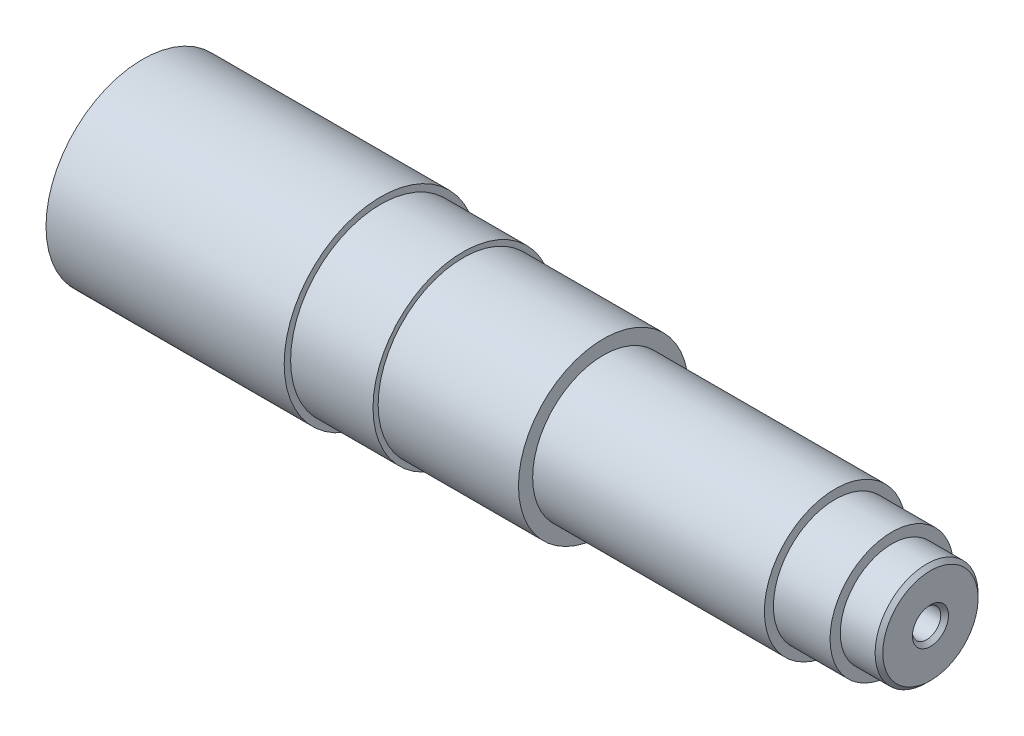
ISO-10303-21;
HEADER;
FILE_DESCRIPTION(('STEP AP214'),'2;1');
FILE_NAME('part.step','',(''),(''),'','','');
FILE_SCHEMA(('AUTOMOTIVE_DESIGN { 1 0 10303 214 1 1 1 1 }'));
ENDSEC;
DATA;
#1=APPLICATION_CONTEXT('core data for automotive mechanical design processes');
#2=APPLICATION_PROTOCOL_DEFINITION('international standard','automotive_design',2000,#1);
#3=PRODUCT_CONTEXT('',#1,'mechanical');
#4=PRODUCT('Part','Part','',(#3));
#5=PRODUCT_RELATED_PRODUCT_CATEGORY('part','',(#4));
#6=PRODUCT_DEFINITION_FORMATION('','',#4);
#7=PRODUCT_DEFINITION_CONTEXT('part definition',#1,'design');
#8=PRODUCT_DEFINITION('design','',#6,#7);
#9=PRODUCT_DEFINITION_SHAPE('','',#8);
#10=(LENGTH_UNIT() NAMED_UNIT(*) SI_UNIT(.MILLI.,.METRE.));
#11=(NAMED_UNIT(*) PLANE_ANGLE_UNIT() SI_UNIT($,.RADIAN.));
#12=(NAMED_UNIT(*) SI_UNIT($,.STERADIAN.) SOLID_ANGLE_UNIT());
#13=UNCERTAINTY_MEASURE_WITH_UNIT(LENGTH_MEASURE(1.E-05),#10,'distance_accuracy_value','');
#14=(GEOMETRIC_REPRESENTATION_CONTEXT(3) GLOBAL_UNCERTAINTY_ASSIGNED_CONTEXT((#13)) GLOBAL_UNIT_ASSIGNED_CONTEXT((#10,
#11,#12)) REPRESENTATION_CONTEXT('',''));
#15=CARTESIAN_POINT('',(0.,0.,0.));
#16=DIRECTION('',(0.,0.,1.));
#17=DIRECTION('',(1.,0.,0.));
#18=AXIS2_PLACEMENT_3D('',#15,#16,#17);
#19=CARTESIAN_POINT('',(0.,0.,0.));
#20=DIRECTION('',(1.,0.,0.));
#21=DIRECTION('',(0.,0.,-1.));
#22=AXIS2_PLACEMENT_3D('',#19,#20,#21);
#23=PLANE('',#22);
#24=CARTESIAN_POINT('',(0.,0.,0.));
#25=DIRECTION('',(-1.,0.,0.));
#26=DIRECTION('',(0.,0.,1.));
#27=AXIS2_PLACEMENT_3D('',#24,#25,#26);
#28=CIRCLE('',#27,7.);
#29=CARTESIAN_POINT('',(0.,0.,7.));
#30=VERTEX_POINT('',#29);
#31=EDGE_CURVE('E64',#30,#30,#28,.T.);
#32=ORIENTED_EDGE('',*,*,#31,.F.);
#33=EDGE_LOOP('',(#32));
#34=FACE_BOUND('',#33,.T.);
#35=CARTESIAN_POINT('',(0.,0.,0.));
#36=DIRECTION('',(-1.,0.,0.));
#37=DIRECTION('',(0.,0.,1.));
#38=AXIS2_PLACEMENT_3D('',#35,#36,#37);
#39=CIRCLE('',#38,12.2);
#40=CARTESIAN_POINT('',(0.,0.,12.2));
#41=VERTEX_POINT('',#40);
#42=EDGE_CURVE('E11',#41,#41,#39,.T.);
#43=ORIENTED_EDGE('',*,*,#42,.T.);
#44=EDGE_LOOP('',(#43));
#45=FACE_BOUND('',#44,.T.);
#46=ADVANCED_FACE('F39',(#34,#45),#23,.F.);
#47=CARTESIAN_POINT('',(2.5,0.,0.));
#48=DIRECTION('',(1.,0.,0.));
#49=DIRECTION('',(0.,0.,-1.));
#50=AXIS2_PLACEMENT_3D('',#47,#48,#49);
#51=CONICAL_SURFACE('',#50,14.7,0.785398163397448);
#52=ORIENTED_EDGE('',*,*,#42,.F.);
#53=EDGE_LOOP('',(#52));
#54=FACE_BOUND('',#53,.T.);
#55=CARTESIAN_POINT('',(2.5,0.,0.));
#56=DIRECTION('',(-1.,0.,0.));
#57=DIRECTION('',(0.,0.,1.));
#58=AXIS2_PLACEMENT_3D('',#55,#56,#57);
#59=CIRCLE('',#58,14.7);
#60=CARTESIAN_POINT('',(2.5,0.,14.7));
#61=VERTEX_POINT('',#60);
#62=EDGE_CURVE('E47',#61,#61,#59,.T.);
#63=ORIENTED_EDGE('',*,*,#62,.T.);
#64=EDGE_LOOP('',(#63));
#65=FACE_BOUND('',#64,.T.);
#66=ADVANCED_FACE('F143',(#54,#65),#51,.T.);
#67=CARTESIAN_POINT('',(0.,0.,0.));
#68=DIRECTION('',(-1.,0.,0.));
#69=DIRECTION('',(0.,0.,1.));
#70=AXIS2_PLACEMENT_3D('',#67,#68,#69);
#71=CYLINDRICAL_SURFACE('',#70,14.7);
#72=ORIENTED_EDGE('',*,*,#62,.F.);
#73=EDGE_LOOP('',(#72));
#74=FACE_BOUND('',#73,.T.);
#75=CARTESIAN_POINT('',(17.,0.,0.));
#76=DIRECTION('',(-1.,0.,0.));
#77=DIRECTION('',(0.,0.,1.));
#78=AXIS2_PLACEMENT_3D('',#75,#76,#77);
#79=CIRCLE('',#78,14.7);
#80=CARTESIAN_POINT('',(17.,0.,14.7));
#81=VERTEX_POINT('',#80);
#82=EDGE_CURVE('E136',#81,#81,#79,.T.);
#83=ORIENTED_EDGE('',*,*,#82,.T.);
#84=EDGE_LOOP('',(#83));
#85=FACE_BOUND('',#84,.T.);
#86=ADVANCED_FACE('F145',(#74,#85),#71,.T.);
#87=CARTESIAN_POINT('',(17.,14.7,0.));
#88=DIRECTION('',(1.,0.,0.));
#89=DIRECTION('',(0.,0.,-1.));
#90=AXIS2_PLACEMENT_3D('',#87,#88,#89);
#91=PLANE('',#90);
#92=ORIENTED_EDGE('',*,*,#82,.F.);
#93=EDGE_LOOP('',(#92));
#94=FACE_BOUND('',#93,.T.);
#95=CARTESIAN_POINT('',(17.,0.,0.));
#96=DIRECTION('',(-1.,0.,0.));
#97=DIRECTION('',(0.,0.,1.));
#98=AXIS2_PLACEMENT_3D('',#95,#96,#97);
#99=CIRCLE('',#98,37.5);
#100=CARTESIAN_POINT('',(17.,0.,37.5));
#101=VERTEX_POINT('',#100);
#102=EDGE_CURVE('E132',#101,#101,#99,.T.);
#103=ORIENTED_EDGE('',*,*,#102,.T.);
#104=EDGE_LOOP('',(#103));
#105=FACE_BOUND('',#104,.T.);
#106=ADVANCED_FACE('F148',(#94,#105),#91,.F.);
#107=CARTESIAN_POINT('',(0.,0.,0.));
#108=DIRECTION('',(-1.,0.,0.));
#109=DIRECTION('',(0.,0.,1.));
#110=AXIS2_PLACEMENT_3D('',#107,#108,#109);
#111=CYLINDRICAL_SURFACE('',#110,37.5);
#112=ORIENTED_EDGE('',*,*,#102,.F.);
#113=EDGE_LOOP('',(#112));
#114=FACE_BOUND('',#113,.T.);
#115=CARTESIAN_POINT('',(109.5,0.,0.));
#116=DIRECTION('',(-1.,0.,0.));
#117=DIRECTION('',(0.,0.,1.));
#118=AXIS2_PLACEMENT_3D('',#115,#116,#117);
#119=CIRCLE('',#118,37.5);
#120=CARTESIAN_POINT('',(109.5,0.,37.5));
#121=VERTEX_POINT('',#120);
#122=EDGE_CURVE('E128',#121,#121,#119,.T.);
#123=ORIENTED_EDGE('',*,*,#122,.T.);
#124=EDGE_LOOP('',(#123));
#125=FACE_BOUND('',#124,.T.);
#126=ADVANCED_FACE('F154',(#114,#125),#111,.T.);
#127=CARTESIAN_POINT('',(109.5,37.5,0.));
#128=DIRECTION('',(-1.,0.,0.));
#129=DIRECTION('',(0.,0.,1.));
#130=AXIS2_PLACEMENT_3D('',#127,#128,#129);
#131=PLANE('',#130);
#132=ORIENTED_EDGE('',*,*,#122,.F.);
#133=EDGE_LOOP('',(#132));
#134=FACE_BOUND('',#133,.T.);
#135=CARTESIAN_POINT('',(109.5,0.,0.));
#136=DIRECTION('',(-1.,0.,0.));
#137=DIRECTION('',(0.,0.,1.));
#138=AXIS2_PLACEMENT_3D('',#135,#136,#137);
#139=CIRCLE('',#138,35.);
#140=CARTESIAN_POINT('',(109.5,0.,35.));
#141=VERTEX_POINT('',#140);
#142=EDGE_CURVE('E124',#141,#141,#139,.T.);
#143=ORIENTED_EDGE('',*,*,#142,.T.);
#144=EDGE_LOOP('',(#143));
#145=FACE_BOUND('',#144,.T.);
#146=ADVANCED_FACE('F160',(#134,#145),#131,.F.);
#147=CARTESIAN_POINT('',(0.,0.,0.));
#148=DIRECTION('',(-1.,0.,0.));
#149=DIRECTION('',(0.,0.,1.));
#150=AXIS2_PLACEMENT_3D('',#147,#148,#149);
#151=CYLINDRICAL_SURFACE('',#150,35.);
#152=ORIENTED_EDGE('',*,*,#142,.F.);
#153=EDGE_LOOP('',(#152));
#154=FACE_BOUND('',#153,.T.);
#155=CARTESIAN_POINT('',(141.5,0.,0.));
#156=DIRECTION('',(-1.,0.,0.));
#157=DIRECTION('',(0.,0.,1.));
#158=AXIS2_PLACEMENT_3D('',#155,#156,#157);
#159=CIRCLE('',#158,35.);
#160=CARTESIAN_POINT('',(141.5,0.,35.));
#161=VERTEX_POINT('',#160);
#162=EDGE_CURVE('E120',#161,#161,#159,.T.);
#163=ORIENTED_EDGE('',*,*,#162,.T.);
#164=EDGE_LOOP('',(#163));
#165=FACE_BOUND('',#164,.T.);
#166=ADVANCED_FACE('F166',(#154,#165),#151,.T.);
#167=CARTESIAN_POINT('',(141.5,35.,0.));
#168=DIRECTION('',(-1.,0.,0.));
#169=DIRECTION('',(0.,0.,1.));
#170=AXIS2_PLACEMENT_3D('',#167,#168,#169);
#171=PLANE('',#170);
#172=ORIENTED_EDGE('',*,*,#162,.F.);
#173=EDGE_LOOP('',(#172));
#174=FACE_BOUND('',#173,.T.);
#175=CARTESIAN_POINT('',(141.5,0.,0.));
#176=DIRECTION('',(-1.,0.,0.));
#177=DIRECTION('',(0.,0.,1.));
#178=AXIS2_PLACEMENT_3D('',#175,#176,#177);
#179=CIRCLE('',#178,33.);
#180=CARTESIAN_POINT('',(141.5,0.,33.));
#181=VERTEX_POINT('',#180);
#182=EDGE_CURVE('E116',#181,#181,#179,.T.);
#183=ORIENTED_EDGE('',*,*,#182,.T.);
#184=EDGE_LOOP('',(#183));
#185=FACE_BOUND('',#184,.T.);
#186=ADVANCED_FACE('F172',(#174,#185),#171,.F.);
#187=CARTESIAN_POINT('',(0.,0.,0.));
#188=DIRECTION('',(-1.,0.,0.));
#189=DIRECTION('',(0.,0.,1.));
#190=AXIS2_PLACEMENT_3D('',#187,#188,#189);
#191=CYLINDRICAL_SURFACE('',#190,33.);
#192=ORIENTED_EDGE('',*,*,#182,.F.);
#193=EDGE_LOOP('',(#192));
#194=FACE_BOUND('',#193,.T.);
#195=CARTESIAN_POINT('',(196.,0.,0.));
#196=DIRECTION('',(-1.,0.,0.));
#197=DIRECTION('',(0.,0.,1.));
#198=AXIS2_PLACEMENT_3D('',#195,#196,#197);
#199=CIRCLE('',#198,33.);
#200=CARTESIAN_POINT('',(196.,0.,33.));
#201=VERTEX_POINT('',#200);
#202=EDGE_CURVE('E112',#201,#201,#199,.T.);
#203=ORIENTED_EDGE('',*,*,#202,.T.);
#204=EDGE_LOOP('',(#203));
#205=FACE_BOUND('',#204,.T.);
#206=ADVANCED_FACE('F178',(#194,#205),#191,.T.);
#207=CARTESIAN_POINT('',(196.,33.,0.));
#208=DIRECTION('',(-1.,0.,0.));
#209=DIRECTION('',(0.,0.,1.));
#210=AXIS2_PLACEMENT_3D('',#207,#208,#209);
#211=PLANE('',#210);
#212=ORIENTED_EDGE('',*,*,#202,.F.);
#213=EDGE_LOOP('',(#212));
#214=FACE_BOUND('',#213,.T.);
#215=CARTESIAN_POINT('',(196.,0.,0.));
#216=DIRECTION('',(-1.,0.,0.));
#217=DIRECTION('',(0.,0.,1.));
#218=AXIS2_PLACEMENT_3D('',#215,#216,#217);
#219=CIRCLE('',#218,27.5);
#220=CARTESIAN_POINT('',(196.,0.,27.5));
#221=VERTEX_POINT('',#220);
#222=EDGE_CURVE('E108',#221,#221,#219,.T.);
#223=ORIENTED_EDGE('',*,*,#222,.T.);
#224=EDGE_LOOP('',(#223));
#225=FACE_BOUND('',#224,.T.);
#226=ADVANCED_FACE('F184',(#214,#225),#211,.F.);
#227=CARTESIAN_POINT('',(0.,0.,0.));
#228=DIRECTION('',(-1.,0.,0.));
#229=DIRECTION('',(0.,0.,1.));
#230=AXIS2_PLACEMENT_3D('',#227,#228,#229);
#231=CYLINDRICAL_SURFACE('',#230,27.5);
#232=ORIENTED_EDGE('',*,*,#222,.F.);
#233=EDGE_LOOP('',(#232));
#234=FACE_BOUND('',#233,.T.);
#235=CARTESIAN_POINT('',(286.,0.,0.));
#236=DIRECTION('',(-1.,0.,0.));
#237=DIRECTION('',(0.,0.,1.));
#238=AXIS2_PLACEMENT_3D('',#235,#236,#237);
#239=CIRCLE('',#238,27.5);
#240=CARTESIAN_POINT('',(286.,0.,27.5));
#241=VERTEX_POINT('',#240);
#242=EDGE_CURVE('E104',#241,#241,#239,.T.);
#243=ORIENTED_EDGE('',*,*,#242,.T.);
#244=EDGE_LOOP('',(#243));
#245=FACE_BOUND('',#244,.T.);
#246=ADVANCED_FACE('F190',(#234,#245),#231,.T.);
#247=CARTESIAN_POINT('',(286.,27.5,0.));
#248=DIRECTION('',(-1.,0.,0.));
#249=DIRECTION('',(0.,0.,1.));
#250=AXIS2_PLACEMENT_3D('',#247,#248,#249);
#251=PLANE('',#250);
#252=ORIENTED_EDGE('',*,*,#242,.F.);
#253=EDGE_LOOP('',(#252));
#254=FACE_BOUND('',#253,.T.);
#255=CARTESIAN_POINT('',(286.,0.,0.));
#256=DIRECTION('',(-1.,0.,0.));
#257=DIRECTION('',(0.,0.,1.));
#258=AXIS2_PLACEMENT_3D('',#255,#256,#257);
#259=CIRCLE('',#258,24.);
#260=CARTESIAN_POINT('',(286.,0.,24.));
#261=VERTEX_POINT('',#260);
#262=EDGE_CURVE('E100',#261,#261,#259,.T.);
#263=ORIENTED_EDGE('',*,*,#262,.T.);
#264=EDGE_LOOP('',(#263));
#265=FACE_BOUND('',#264,.T.);
#266=ADVANCED_FACE('F196',(#254,#265),#251,.F.);
#267=CARTESIAN_POINT('',(0.,0.,0.));
#268=DIRECTION('',(-1.,0.,0.));
#269=DIRECTION('',(0.,0.,1.));
#270=AXIS2_PLACEMENT_3D('',#267,#268,#269);
#271=CYLINDRICAL_SURFACE('',#270,24.);
#272=ORIENTED_EDGE('',*,*,#262,.F.);
#273=EDGE_LOOP('',(#272));
#274=FACE_BOUND('',#273,.T.);
#275=CARTESIAN_POINT('',(308.,0.,0.));
#276=DIRECTION('',(-1.,0.,0.));
#277=DIRECTION('',(0.,0.,1.));
#278=AXIS2_PLACEMENT_3D('',#275,#276,#277);
#279=CIRCLE('',#278,24.);
#280=CARTESIAN_POINT('',(308.,0.,24.));
#281=VERTEX_POINT('',#280);
#282=EDGE_CURVE('E96',#281,#281,#279,.T.);
#283=ORIENTED_EDGE('',*,*,#282,.T.);
#284=EDGE_LOOP('',(#283));
#285=FACE_BOUND('',#284,.T.);
#286=ADVANCED_FACE('F202',(#274,#285),#271,.T.);
#287=CARTESIAN_POINT('',(308.,24.,0.));
#288=DIRECTION('',(-1.,0.,0.));
#289=DIRECTION('',(0.,0.,1.));
#290=AXIS2_PLACEMENT_3D('',#287,#288,#289);
#291=PLANE('',#290);
#292=ORIENTED_EDGE('',*,*,#282,.F.);
#293=EDGE_LOOP('',(#292));
#294=FACE_BOUND('',#293,.T.);
#295=CARTESIAN_POINT('',(308.,0.,0.));
#296=DIRECTION('',(-1.,0.,0.));
#297=DIRECTION('',(0.,0.,1.));
#298=AXIS2_PLACEMENT_3D('',#295,#296,#297);
#299=CIRCLE('',#298,20.);
#300=CARTESIAN_POINT('',(308.,0.,20.));
#301=VERTEX_POINT('',#300);
#302=EDGE_CURVE('E92',#301,#301,#299,.T.);
#303=ORIENTED_EDGE('',*,*,#302,.T.);
#304=EDGE_LOOP('',(#303));
#305=FACE_BOUND('',#304,.T.);
#306=ADVANCED_FACE('F208',(#294,#305),#291,.F.);
#307=CARTESIAN_POINT('',(0.,0.,0.));
#308=DIRECTION('',(-1.,0.,0.));
#309=DIRECTION('',(0.,0.,1.));
#310=AXIS2_PLACEMENT_3D('',#307,#308,#309);
#311=CYLINDRICAL_SURFACE('',#310,20.);
#312=ORIENTED_EDGE('',*,*,#302,.F.);
#313=EDGE_LOOP('',(#312));
#314=FACE_BOUND('',#313,.T.);
#315=CARTESIAN_POINT('',(321.5,0.,0.));
#316=DIRECTION('',(-1.,0.,0.));
#317=DIRECTION('',(0.,0.,1.));
#318=AXIS2_PLACEMENT_3D('',#315,#316,#317);
#319=CIRCLE('',#318,20.);
#320=CARTESIAN_POINT('',(321.5,0.,20.));
#321=VERTEX_POINT('',#320);
#322=EDGE_CURVE('E88',#321,#321,#319,.T.);
#323=ORIENTED_EDGE('',*,*,#322,.T.);
#324=EDGE_LOOP('',(#323));
#325=FACE_BOUND('',#324,.T.);
#326=ADVANCED_FACE('F214',(#314,#325),#311,.T.);
#327=CARTESIAN_POINT('',(323.,0.,0.));
#328=DIRECTION('',(-1.,0.,0.));
#329=DIRECTION('',(0.,0.,1.));
#330=AXIS2_PLACEMENT_3D('',#327,#328,#329);
#331=CONICAL_SURFACE('',#330,18.5,0.785398163397448);
#332=ORIENTED_EDGE('',*,*,#322,.F.);
#333=EDGE_LOOP('',(#332));
#334=FACE_BOUND('',#333,.T.);
#335=CARTESIAN_POINT('',(323.,0.,0.));
#336=DIRECTION('',(-1.,0.,0.));
#337=DIRECTION('',(0.,0.,1.));
#338=AXIS2_PLACEMENT_3D('',#335,#336,#337);
#339=CIRCLE('',#338,18.5);
#340=CARTESIAN_POINT('',(323.,0.,18.5));
#341=VERTEX_POINT('',#340);
#342=EDGE_CURVE('E84',#341,#341,#339,.T.);
#343=ORIENTED_EDGE('',*,*,#342,.T.);
#344=EDGE_LOOP('',(#343));
#345=FACE_BOUND('',#344,.T.);
#346=ADVANCED_FACE('F220',(#334,#345),#331,.T.);
#347=CARTESIAN_POINT('',(323.,18.5,0.));
#348=DIRECTION('',(-1.,0.,0.));
#349=DIRECTION('',(0.,0.,1.));
#350=AXIS2_PLACEMENT_3D('',#347,#348,#349);
#351=PLANE('',#350);
#352=CARTESIAN_POINT('',(323.,0.,0.));
#353=DIRECTION('',(1.,0.,0.));
#354=DIRECTION('',(0.,0.,-1.));
#355=AXIS2_PLACEMENT_3D('',#352,#353,#354);
#356=CIRCLE('',#355,7.);
#357=CARTESIAN_POINT('',(323.,0.,-7.));
#358=VERTEX_POINT('',#357);
#359=EDGE_CURVE('E73',#358,#358,#356,.T.);
#360=ORIENTED_EDGE('',*,*,#359,.F.);
#361=EDGE_LOOP('',(#360));
#362=FACE_BOUND('',#361,.T.);
#363=ORIENTED_EDGE('',*,*,#342,.F.);
#364=EDGE_LOOP('',(#363));
#365=FACE_BOUND('',#364,.T.);
#366=ADVANCED_FACE('F226',(#362,#365),#351,.F.);
#367=CARTESIAN_POINT('',(10.6952665953484,0.,0.));
#368=DIRECTION('',(-1.,0.,0.));
#369=DIRECTION('',(0.,0.,1.));
#370=AXIS2_PLACEMENT_3D('',#367,#368,#369);
#371=CONICAL_SURFACE('',#370,5.5,1.02974425867665);
#372=CARTESIAN_POINT('',(14.,0.,0.));
#373=VERTEX_POINT('',#372);
#374=VERTEX_LOOP('',#373);
#375=FACE_BOUND('',#374,.T.);
#376=CARTESIAN_POINT('',(10.6952665953484,0.,0.));
#377=DIRECTION('',(-1.,0.,0.));
#378=DIRECTION('',(0.,0.,1.));
#379=AXIS2_PLACEMENT_3D('',#376,#377,#378);
#380=CIRCLE('',#379,5.5);
#381=CARTESIAN_POINT('',(10.6952665953484,0.,5.5));
#382=VERTEX_POINT('',#381);
#383=EDGE_CURVE('E80',#382,#382,#380,.T.);
#384=ORIENTED_EDGE('',*,*,#383,.T.);
#385=EDGE_LOOP('',(#384));
#386=FACE_BOUND('',#385,.T.);
#387=ADVANCED_FACE('F231',(#375,#386),#371,.F.);
#388=CARTESIAN_POINT('',(0.,0.,0.));
#389=DIRECTION('',(-1.,0.,0.));
#390=DIRECTION('',(0.,0.,1.));
#391=AXIS2_PLACEMENT_3D('',#388,#389,#390);
#392=CYLINDRICAL_SURFACE('',#391,5.49999999999999);
#393=ORIENTED_EDGE('',*,*,#383,.F.);
#394=EDGE_LOOP('',(#393));
#395=FACE_BOUND('',#394,.T.);
#396=CARTESIAN_POINT('',(1.50000000000003,0.,0.));
#397=DIRECTION('',(-1.,0.,0.));
#398=DIRECTION('',(0.,0.,1.));
#399=AXIS2_PLACEMENT_3D('',#396,#397,#398);
#400=CIRCLE('',#399,5.49999999999999);
#401=CARTESIAN_POINT('',(1.50000000000003,0.,5.49999999999999));
#402=VERTEX_POINT('',#401);
#403=EDGE_CURVE('E70',#402,#402,#400,.T.);
#404=ORIENTED_EDGE('',*,*,#403,.T.);
#405=EDGE_LOOP('',(#404));
#406=FACE_BOUND('',#405,.T.);
#407=ADVANCED_FACE('F237',(#395,#406),#392,.F.);
#408=CARTESIAN_POINT('',(0.,0.,0.));
#409=DIRECTION('',(-1.,0.,0.));
#410=DIRECTION('',(0.,0.,1.));
#411=AXIS2_PLACEMENT_3D('',#408,#409,#410);
#412=CONICAL_SURFACE('',#411,7.,0.785398163397442);
#413=ORIENTED_EDGE('',*,*,#403,.F.);
#414=EDGE_LOOP('',(#413));
#415=FACE_BOUND('',#414,.T.);
#416=ORIENTED_EDGE('',*,*,#31,.T.);
#417=EDGE_LOOP('',(#416));
#418=FACE_BOUND('',#417,.T.);
#419=ADVANCED_FACE('F57',(#415,#418),#412,.F.);
#420=CARTESIAN_POINT('',(312.304733404652,0.,0.));
#421=DIRECTION('',(1.,0.,0.));
#422=DIRECTION('',(0.,0.,-1.));
#423=AXIS2_PLACEMENT_3D('',#420,#421,#422);
#424=CONICAL_SURFACE('',#423,5.5,1.02974425867665);
#425=CARTESIAN_POINT('',(309.,0.,0.));
#426=VERTEX_POINT('',#425);
#427=VERTEX_LOOP('',#426);
#428=FACE_BOUND('',#427,.T.);
#429=CARTESIAN_POINT('',(312.304733404652,0.,0.));
#430=DIRECTION('',(1.,0.,0.));
#431=DIRECTION('',(0.,0.,-1.));
#432=AXIS2_PLACEMENT_3D('',#429,#430,#431);
#433=CIRCLE('',#432,5.5);
#434=CARTESIAN_POINT('',(312.304733404652,0.,-5.5));
#435=VERTEX_POINT('',#434);
#436=EDGE_CURVE('E61',#435,#435,#433,.T.);
#437=ORIENTED_EDGE('',*,*,#436,.T.);
#438=EDGE_LOOP('',(#437));
#439=FACE_BOUND('',#438,.T.);
#440=ADVANCED_FACE('F53',(#428,#439),#424,.F.);
#441=CARTESIAN_POINT('',(323.,0.,0.));
#442=DIRECTION('',(1.,0.,0.));
#443=DIRECTION('',(0.,0.,-1.));
#444=AXIS2_PLACEMENT_3D('',#441,#442,#443);
#445=CYLINDRICAL_SURFACE('',#444,5.49999999999999);
#446=ORIENTED_EDGE('',*,*,#436,.F.);
#447=EDGE_LOOP('',(#446));
#448=FACE_BOUND('',#447,.T.);
#449=CARTESIAN_POINT('',(321.5,0.,0.));
#450=DIRECTION('',(1.,0.,0.));
#451=DIRECTION('',(0.,0.,-1.));
#452=AXIS2_PLACEMENT_3D('',#449,#450,#451);
#453=CIRCLE('',#452,5.49999999999999);
#454=CARTESIAN_POINT('',(321.5,0.,-5.49999999999999));
#455=VERTEX_POINT('',#454);
#456=EDGE_CURVE('E65',#455,#455,#453,.T.);
#457=ORIENTED_EDGE('',*,*,#456,.T.);
#458=EDGE_LOOP('',(#457));
#459=FACE_BOUND('',#458,.T.);
#460=ADVANCED_FACE('F56',(#448,#459),#445,.F.);
#461=CARTESIAN_POINT('',(323.,0.,0.));
#462=DIRECTION('',(1.,0.,0.));
#463=DIRECTION('',(0.,0.,-1.));
#464=AXIS2_PLACEMENT_3D('',#461,#462,#463);
#465=CONICAL_SURFACE('',#464,7.,0.785398163397452);
#466=ORIENTED_EDGE('',*,*,#456,.F.);
#467=EDGE_LOOP('',(#466));
#468=FACE_BOUND('',#467,.T.);
#469=ORIENTED_EDGE('',*,*,#359,.T.);
#470=EDGE_LOOP('',(#469));
#471=FACE_BOUND('',#470,.T.);
#472=ADVANCED_FACE('F262',(#468,#471),#465,.F.);
#473=CLOSED_SHELL('',(#46,#66,#86,#106,#126,#146,#166,#186,#206,#226,#246,#266,#286,#306,#326,
#346,#366,#387,#407,#419,#440,#460,#472));
#474=MANIFOLD_SOLID_BREP('B2',#473);
#475=ADVANCED_BREP_SHAPE_REPRESENTATION('',(#18,#474),#14);
#476=SHAPE_DEFINITION_REPRESENTATION(#9,#475);
ENDSEC;
END-ISO-10303-21;
